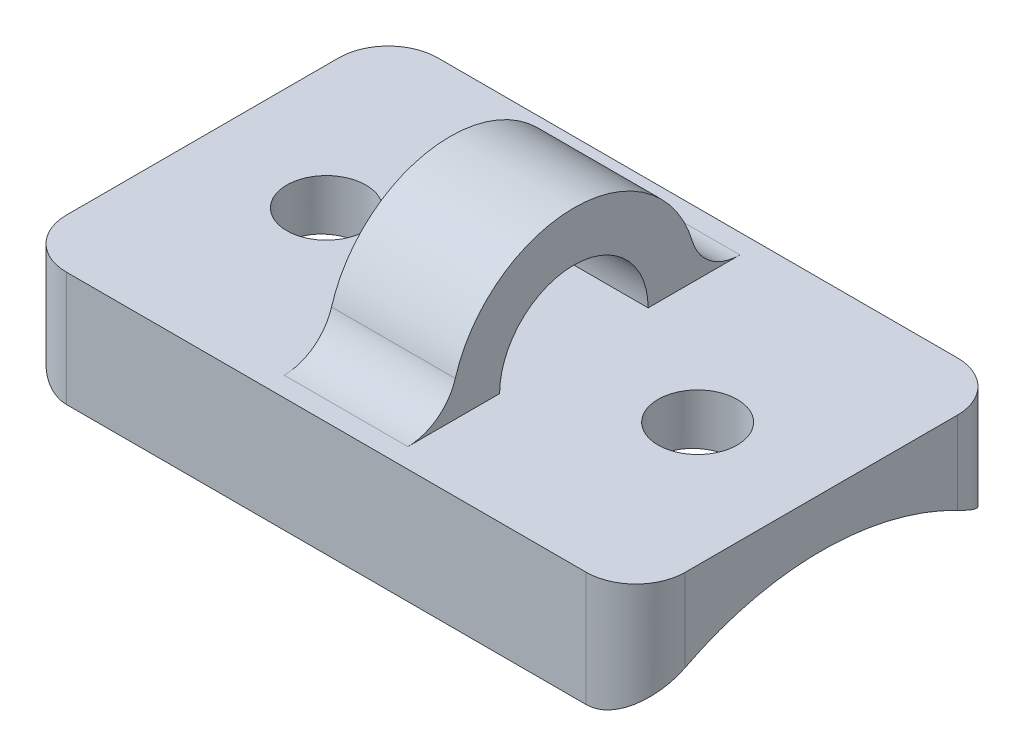
ISO-10303-21;
HEADER;
FILE_DESCRIPTION(('STEP AP214'),'2;1');
FILE_NAME('part.step','',(''),(''),'','','');
FILE_SCHEMA(('AUTOMOTIVE_DESIGN { 1 0 10303 214 1 1 1 1 }'));
ENDSEC;
DATA;
#1=APPLICATION_CONTEXT('core data for automotive mechanical design processes');
#2=APPLICATION_PROTOCOL_DEFINITION('international standard','automotive_design',2000,#1);
#3=PRODUCT_CONTEXT('',#1,'mechanical');
#4=PRODUCT('Part','Part','',(#3));
#5=PRODUCT_RELATED_PRODUCT_CATEGORY('part','',(#4));
#6=PRODUCT_DEFINITION_FORMATION('','',#4);
#7=PRODUCT_DEFINITION_CONTEXT('part definition',#1,'design');
#8=PRODUCT_DEFINITION('design','',#6,#7);
#9=PRODUCT_DEFINITION_SHAPE('','',#8);
#10=(LENGTH_UNIT() NAMED_UNIT(*) SI_UNIT(.MILLI.,.METRE.));
#11=(NAMED_UNIT(*) PLANE_ANGLE_UNIT() SI_UNIT($,.RADIAN.));
#12=(NAMED_UNIT(*) SI_UNIT($,.STERADIAN.) SOLID_ANGLE_UNIT());
#13=UNCERTAINTY_MEASURE_WITH_UNIT(LENGTH_MEASURE(1.E-05),#10,'distance_accuracy_value','');
#14=(GEOMETRIC_REPRESENTATION_CONTEXT(3) GLOBAL_UNCERTAINTY_ASSIGNED_CONTEXT((#13)) GLOBAL_UNIT_ASSIGNED_CONTEXT((#10,
#11,#12)) REPRESENTATION_CONTEXT('',''));
#15=CARTESIAN_POINT('',(0.,0.,0.));
#16=DIRECTION('',(0.,0.,1.));
#17=DIRECTION('',(1.,0.,0.));
#18=AXIS2_PLACEMENT_3D('',#15,#16,#17);
#19=CARTESIAN_POINT('',(12.5,14.,7.5));
#20=DIRECTION('',(0.,-1.,0.));
#21=DIRECTION('',(0.,0.,-1.));
#22=AXIS2_PLACEMENT_3D('',#19,#20,#21);
#23=PLANE('',#22);
#24=CARTESIAN_POINT('',(-7.5,14.,0.));
#25=DIRECTION('',(0.,1.,0.));
#26=DIRECTION('',(0.,0.,1.));
#27=AXIS2_PLACEMENT_3D('',#24,#25,#26);
#28=CIRCLE('',#27,1.59999999999999);
#29=CARTESIAN_POINT('',(-7.5,14.,1.59999999999999));
#30=VERTEX_POINT('',#29);
#31=EDGE_CURVE('E334',#30,#30,#28,.T.);
#32=ORIENTED_EDGE('',*,*,#31,.F.);
#33=EDGE_LOOP('',(#32));
#34=FACE_BOUND('',#33,.T.);
#35=CARTESIAN_POINT('',(7.5,14.,0.));
#36=DIRECTION('',(0.,1.,0.));
#37=DIRECTION('',(0.,0.,1.));
#38=AXIS2_PLACEMENT_3D('',#35,#36,#37);
#39=CIRCLE('',#38,1.59999999999999);
#40=CARTESIAN_POINT('',(7.5,14.,1.59999999999999));
#41=VERTEX_POINT('',#40);
#42=EDGE_CURVE('E296',#41,#41,#39,.T.);
#43=ORIENTED_EDGE('',*,*,#42,.F.);
#44=EDGE_LOOP('',(#43));
#45=FACE_BOUND('',#44,.T.);
#46=DIRECTION('',(0.,0.,-1.));
#47=VECTOR('',#46,1.);
#48=CARTESIAN_POINT('',(-2.5,14.,-3.));
#49=LINE('',#48,#47);
#50=CARTESIAN_POINT('',(-2.5,14.,-3.));
#51=VERTEX_POINT('',#50);
#52=CARTESIAN_POINT('',(-2.5,14.,-6.70820393249937));
#53=VERTEX_POINT('',#52);
#54=EDGE_CURVE('E340',#51,#53,#49,.T.);
#55=ORIENTED_EDGE('',*,*,#54,.T.);
#56=DIRECTION('',(1.,0.,0.));
#57=VECTOR('',#56,1.);
#58=CARTESIAN_POINT('',(2.5,14.,-6.70820393249937));
#59=LINE('',#58,#57);
#60=CARTESIAN_POINT('',(2.5,14.,-6.70820393249937));
#61=VERTEX_POINT('',#60);
#62=EDGE_CURVE('E220',#53,#61,#59,.T.);
#63=ORIENTED_EDGE('',*,*,#62,.T.);
#64=DIRECTION('',(0.,0.,-1.));
#65=VECTOR('',#64,1.);
#66=CARTESIAN_POINT('',(2.5,14.,-3.));
#67=LINE('',#66,#65);
#68=CARTESIAN_POINT('',(2.5,14.,-3.));
#69=VERTEX_POINT('',#68);
#70=EDGE_CURVE('E167',#69,#61,#67,.T.);
#71=ORIENTED_EDGE('',*,*,#70,.F.);
#72=DIRECTION('',(-1.,0.,0.));
#73=VECTOR('',#72,1.);
#74=CARTESIAN_POINT('',(2.5,14.,-3.));
#75=LINE('',#74,#73);
#76=EDGE_CURVE('E164',#69,#51,#75,.T.);
#77=ORIENTED_EDGE('',*,*,#76,.T.);
#78=EDGE_LOOP('',(#55,#63,#71,#77));
#79=FACE_BOUND('',#78,.T.);
#80=DIRECTION('',(0.,0.,1.));
#81=VECTOR('',#80,1.);
#82=CARTESIAN_POINT('',(12.5,14.,7.5));
#83=LINE('',#82,#81);
#84=CARTESIAN_POINT('',(12.5,14.,-5.5));
#85=VERTEX_POINT('',#84);
#86=CARTESIAN_POINT('',(12.5,14.,5.5));
#87=VERTEX_POINT('',#86);
#88=EDGE_CURVE('E186',#85,#87,#83,.T.);
#89=ORIENTED_EDGE('',*,*,#88,.F.);
#90=CARTESIAN_POINT('',(10.5,14.,-5.5));
#91=DIRECTION('',(0.,-1.,0.));
#92=DIRECTION('',(0.,0.,-1.));
#93=AXIS2_PLACEMENT_3D('',#90,#91,#92);
#94=CIRCLE('',#93,2.);
#95=CARTESIAN_POINT('',(10.5,14.,-7.5));
#96=VERTEX_POINT('',#95);
#97=EDGE_CURVE('E233',#85,#96,#94,.F.);
#98=ORIENTED_EDGE('',*,*,#97,.T.);
#99=DIRECTION('',(-1.,0.,0.));
#100=VECTOR('',#99,1.);
#101=CARTESIAN_POINT('',(12.5,14.,-7.5));
#102=LINE('',#101,#100);
#103=CARTESIAN_POINT('',(-10.5,14.,-7.5));
#104=VERTEX_POINT('',#103);
#105=EDGE_CURVE('E201',#96,#104,#102,.T.);
#106=ORIENTED_EDGE('',*,*,#105,.T.);
#107=CARTESIAN_POINT('',(-10.5,14.,-5.5));
#108=DIRECTION('',(0.,-1.,0.));
#109=DIRECTION('',(0.,0.,-1.));
#110=AXIS2_PLACEMENT_3D('',#107,#108,#109);
#111=CIRCLE('',#110,2.);
#112=CARTESIAN_POINT('',(-12.5,14.,-5.5));
#113=VERTEX_POINT('',#112);
#114=EDGE_CURVE('E230',#104,#113,#111,.F.);
#115=ORIENTED_EDGE('',*,*,#114,.T.);
#116=DIRECTION('',(0.,0.,1.));
#117=VECTOR('',#116,1.);
#118=CARTESIAN_POINT('',(-12.5,14.,7.5));
#119=LINE('',#118,#117);
#120=CARTESIAN_POINT('',(-12.5,14.,5.5));
#121=VERTEX_POINT('',#120);
#122=EDGE_CURVE('E177',#113,#121,#119,.T.);
#123=ORIENTED_EDGE('',*,*,#122,.T.);
#124=CARTESIAN_POINT('',(-10.5,14.,5.5));
#125=DIRECTION('',(0.,-1.,0.));
#126=DIRECTION('',(0.,0.,-1.));
#127=AXIS2_PLACEMENT_3D('',#124,#125,#126);
#128=CIRCLE('',#127,2.);
#129=CARTESIAN_POINT('',(-10.5,14.,7.5));
#130=VERTEX_POINT('',#129);
#131=EDGE_CURVE('E227',#121,#130,#128,.F.);
#132=ORIENTED_EDGE('',*,*,#131,.T.);
#133=DIRECTION('',(-1.,0.,0.));
#134=VECTOR('',#133,1.);
#135=CARTESIAN_POINT('',(12.5,14.,7.5));
#136=LINE('',#135,#134);
#137=CARTESIAN_POINT('',(10.5,14.,7.5));
#138=VERTEX_POINT('',#137);
#139=EDGE_CURVE('E197',#138,#130,#136,.T.);
#140=ORIENTED_EDGE('',*,*,#139,.F.);
#141=CARTESIAN_POINT('',(10.5,14.,5.5));
#142=DIRECTION('',(0.,-1.,0.));
#143=DIRECTION('',(0.,0.,-1.));
#144=AXIS2_PLACEMENT_3D('',#141,#142,#143);
#145=CIRCLE('',#144,2.);
#146=EDGE_CURVE('E224',#138,#87,#145,.F.);
#147=ORIENTED_EDGE('',*,*,#146,.T.);
#148=EDGE_LOOP('',(#89,#98,#106,#115,#123,#132,#140,#147));
#149=FACE_BOUND('',#148,.T.);
#150=DIRECTION('',(1.,0.,0.));
#151=VECTOR('',#150,1.);
#152=CARTESIAN_POINT('',(-2.5,14.,6.70820393249937));
#153=LINE('',#152,#151);
#154=CARTESIAN_POINT('',(2.5,14.,6.70820393249937));
#155=VERTEX_POINT('',#154);
#156=CARTESIAN_POINT('',(-2.5,14.,6.70820393249937));
#157=VERTEX_POINT('',#156);
#158=EDGE_CURVE('E217',#155,#157,#153,.F.);
#159=ORIENTED_EDGE('',*,*,#158,.T.);
#160=DIRECTION('',(0.,0.,-1.));
#161=VECTOR('',#160,1.);
#162=CARTESIAN_POINT('',(-2.5,14.,5.));
#163=LINE('',#162,#161);
#164=CARTESIAN_POINT('',(-2.5,14.,3.));
#165=VERTEX_POINT('',#164);
#166=EDGE_CURVE('E169',#157,#165,#163,.T.);
#167=ORIENTED_EDGE('',*,*,#166,.T.);
#168=DIRECTION('',(-1.,0.,0.));
#169=VECTOR('',#168,1.);
#170=CARTESIAN_POINT('',(2.5,14.,3.));
#171=LINE('',#170,#169);
#172=CARTESIAN_POINT('',(2.5,14.,3.));
#173=VERTEX_POINT('',#172);
#174=EDGE_CURVE('E161',#173,#165,#171,.T.);
#175=ORIENTED_EDGE('',*,*,#174,.F.);
#176=DIRECTION('',(0.,0.,-1.));
#177=VECTOR('',#176,1.);
#178=CARTESIAN_POINT('',(2.5,14.,5.));
#179=LINE('',#178,#177);
#180=EDGE_CURVE('E145',#155,#173,#179,.T.);
#181=ORIENTED_EDGE('',*,*,#180,.F.);
#182=EDGE_LOOP('',(#159,#167,#175,#181));
#183=FACE_BOUND('',#182,.T.);
#184=ADVANCED_FACE('F38',(#34,#45,#79,#149,#183),#23,.F.);
#185=CARTESIAN_POINT('',(12.5,0.,0.));
#186=DIRECTION('',(-1.,0.,0.));
#187=DIRECTION('',(0.,0.,1.));
#188=AXIS2_PLACEMENT_3D('',#185,#186,#187);
#189=CYLINDRICAL_SURFACE('',#188,12.);
#190=CARTESIAN_POINT('',(-7.5,11.8928549978548,1.6));
#191=CARTESIAN_POINT('',(-7.41055691563181,11.8928563562661,1.59999622875873));
#192=CARTESIAN_POINT('',(-7.32105917352575,11.8938749179493,1.59247461363655));
#193=CARTESIAN_POINT('',(-7.14455803014886,11.8978371896282,1.56259037013243));
#194=CARTESIAN_POINT('',(-7.05755727606974,11.9007828692913,1.54021255719325));
#195=CARTESIAN_POINT('',(-6.88863090541277,11.9082599369349,1.48129048912082));
#196=CARTESIAN_POINT('',(-6.8067017507042,11.9127902044355,1.44475624220001));
#197=CARTESIAN_POINT('',(-6.65015113943402,11.9229246580757,1.35858051904583));
#198=CARTESIAN_POINT('',(-6.57552851285003,11.9285286718458,1.30894114610784));
#199=CARTESIAN_POINT('',(-6.43522123626478,11.9402190185494,1.19762696391604));
#200=CARTESIAN_POINT('',(-6.36958970745638,11.9463079079454,1.13588545819885));
#201=CARTESIAN_POINT('',(-6.24958700363502,11.9582590100703,1.0022633829809));
#202=CARTESIAN_POINT('',(-6.19521640681908,11.9641212111471,0.93038229317759));
#203=CARTESIAN_POINT('',(-6.09908652662685,11.9749847980817,0.778185379942081));
#204=CARTESIAN_POINT('',(-6.0573756085678,11.9799828520179,0.697838750168974));
#205=CARTESIAN_POINT('',(-5.98805906865538,11.9885268273268,0.531203052829894));
#206=CARTESIAN_POINT('',(-5.96045285409787,11.9920728097169,0.44491423513792));
#207=CARTESIAN_POINT('',(-5.92028887233579,11.9972950895648,0.269388300011272));
#208=CARTESIAN_POINT('',(-5.90764254799044,11.9989823856406,0.180171778775919));
#209=CARTESIAN_POINT('',(-5.89748271301055,12.0003347837722,0.000868001842927265));
#210=CARTESIAN_POINT('',(-5.8999685298108,11.9999999757026,-0.0892192149779704));
#211=CARTESIAN_POINT('',(-5.91993178443277,11.9973547529353,-0.267104099572612));
#212=CARTESIAN_POINT('',(-5.93731397179653,11.9950568907025,-0.354912669889424));
#213=CARTESIAN_POINT('',(-5.98642746161722,11.9887577927383,-0.526355298170039));
#214=CARTESIAN_POINT('',(-6.0181590681345,11.9847565209123,-0.609989267633466));
#215=CARTESIAN_POINT('',(-6.09517075289747,11.9754785520333,-0.771001446739297));
#216=CARTESIAN_POINT('',(-6.14049169854648,11.970198017167,-0.848359879482602));
#217=CARTESIAN_POINT('',(-6.24336580582629,11.9589516033523,-0.994409352587822));
#218=CARTESIAN_POINT('',(-6.30091960530225,11.9529856886743,-1.06309994069345));
#219=CARTESIAN_POINT('',(-6.42715827868715,11.9409807047653,-1.1904240492363));
#220=CARTESIAN_POINT('',(-6.49592621455491,11.9349414273952,-1.24897522682416));
#221=CARTESIAN_POINT('',(-6.64235674509806,11.9235159901539,-1.35371754445752));
#222=CARTESIAN_POINT('',(-6.72001937504238,11.9181298328726,-1.39990863549082));
#223=CARTESIAN_POINT('',(-6.88211200027737,11.9086206106747,-1.47862628869199));
#224=CARTESIAN_POINT('',(-6.9665455236148,11.9044982097183,-1.51114567125364));
#225=CARTESIAN_POINT('',(-7.1397424165107,11.8979958037258,-1.56152072035938));
#226=CARTESIAN_POINT('',(-7.22850554722126,11.8956157026893,-1.57937719483314));
#227=CARTESIAN_POINT('',(-7.40711306800397,11.8928851600828,-1.5998092861498));
#228=CARTESIAN_POINT('',(-7.49694394426603,11.892519292093,-1.60250104879049));
#229=CARTESIAN_POINT('',(-7.67577540488379,11.8938177943736,-1.59283430551036));
#230=CARTESIAN_POINT('',(-7.76477600939156,11.895482115238,-1.5804761658382));
#231=CARTESIAN_POINT('',(-7.93906878912449,11.9006393634942,-1.54115844029615));
#232=CARTESIAN_POINT('',(-8.02437399441448,11.9041251823012,-1.51425560258687));
#233=CARTESIAN_POINT('',(-8.18926313076195,11.9125268721153,-1.44667076064099));
#234=CARTESIAN_POINT('',(-8.26884683465897,11.9174427998627,-1.40598820967505));
#235=CARTESIAN_POINT('',(-8.42055784835265,11.9281875729561,-1.31171525133768));
#236=CARTESIAN_POINT('',(-8.49263763869459,11.9340217103131,-1.25804898533039));
#237=CARTESIAN_POINT('',(-8.62680875074967,11.9459291481321,-1.13943865850238));
#238=CARTESIAN_POINT('',(-8.68889962891841,11.9520024591995,-1.07449409715002));
#239=CARTESIAN_POINT('',(-8.80174124313689,11.9637515892427,-0.934662038686582));
#240=CARTESIAN_POINT('',(-8.85241545309728,11.9694245603977,-0.859712512746012));
#241=CARTESIAN_POINT('',(-8.94045462574026,11.9796907318264,-0.70229796185409));
#242=CARTESIAN_POINT('',(-8.97781988780488,11.9842839563879,-0.619833106010954));
#243=CARTESIAN_POINT('',(-9.0380554092705,11.9918605175292,-0.449978218018742));
#244=CARTESIAN_POINT('',(-9.06096914326683,11.9948486785663,-0.362603827397885));
#245=CARTESIAN_POINT('',(-9.09179238836878,11.9988985334929,-0.185205194738555));
#246=CARTESIAN_POINT('',(-9.09970267416616,11.999960326849,-0.095181089759855));
#247=CARTESIAN_POINT('',(-9.10027861379225,12.0000371779874,0.0842158989692738));
#248=CARTESIAN_POINT('',(-9.09306197647551,11.9990680393074,0.173588420737507));
#249=CARTESIAN_POINT('',(-9.06383916701441,11.9952234657589,0.349837954441884));
#250=CARTESIAN_POINT('',(-9.04183301558295,11.9923480335601,0.436714969872839));
#251=CARTESIAN_POINT('',(-8.98369436233866,11.9850124531398,0.605486587671088));
#252=CARTESIAN_POINT('',(-8.94756829887355,11.9805530272665,0.687383441235129));
#253=CARTESIAN_POINT('',(-8.8622275602834,11.9705419951679,0.843971262904699));
#254=CARTESIAN_POINT('',(-8.81301264347804,11.9649903687759,0.918662097919331));
#255=CARTESIAN_POINT('',(-8.70245865439708,11.9533623296788,1.05931782885339));
#256=CARTESIAN_POINT('',(-8.64103216788865,11.9472823223993,1.1252137257312));
#257=CARTESIAN_POINT('',(-8.5079815447621,11.9353109191741,1.24580716469773));
#258=CARTESIAN_POINT('',(-8.43635500486297,11.9294195680805,1.30050206024185));
#259=CARTESIAN_POINT('',(-8.2845728467433,11.9184648790805,1.39735032782796));
#260=CARTESIAN_POINT('',(-8.20438112679198,11.9134052940863,1.43944752343302));
#261=CARTESIAN_POINT('',(-8.03804122598629,11.9047309326699,1.5095161462519));
#262=CARTESIAN_POINT('',(-7.95189954419226,11.9011146081783,1.53750271733087));
#263=CARTESIAN_POINT('',(-7.80444137701973,11.8966010705995,1.5719638430287));
#264=CARTESIAN_POINT('',(-7.74404938162601,11.8952034289778,1.58246198508654));
#265=CARTESIAN_POINT('',(-7.62244679242308,11.8933299317957,1.59648132274532));
#266=CARTESIAN_POINT('',(-7.56123620608016,11.8928540678337,1.60000258193809));
#267=CARTESIAN_POINT('',(-7.5,11.8928549978548,1.6));
#268=B_SPLINE_CURVE_WITH_KNOTS('',3,(#190,#191,#192,#193,#194,#195,#196,#197,#198,#199,#200,
#201,#202,#203,#204,#205,#206,#207,#208,#209,#210,#211,#212,#213,#214,#215,#216,#217,#218,#219,
#220,#221,#222,#223,#224,#225,#226,#227,#228,#229,#230,#231,#232,#233,#234,#235,#236,#237,#238,
#239,#240,#241,#242,#243,#244,#245,#246,#247,#248,#249,#250,#251,#252,#253,#254,#255,#256,#257,
#258,#259,#260,#261,#262,#263,#264,#265,#266,#267),.UNSPECIFIED.,.T.,.F.,(4,2,2,2,2,2,2,2,2,2,2,
2,2,2,2,2,2,2,2,2,2,2,2,2,2,2,2,2,2,2,2,2,2,2,2,2,2,2,4),(0.,0.268105511391278,
0.536485476866912,0.80467605019696,1.07282360666201,1.34249276095168,1.61217575808027,
1.88287645218353,2.15356577003778,2.42264455618211,2.69171138290121,2.95907046934198,
3.22643522131578,3.49461222763236,3.76280322065938,4.03307932053402,4.30335649213508,
4.57377542122827,4.84417944917516,5.11250962063778,5.38083326225068,5.6481174785311,
5.91541230092802,6.184308225121,6.45321608598731,6.72387609409837,6.99453001338355,
7.26436579014501,7.53418763375951,7.80191767883273,8.06964734894746,8.33725508278388,
8.60486775823095,8.87446993893387,9.14413574725753,9.41498673583912,9.68554641848823,
9.86910352753636,10.0526589635184),.UNSPECIFIED.);
#269=CARTESIAN_POINT('',(-7.5,11.8928549978548,1.6));
#270=VERTEX_POINT('',#269);
#271=EDGE_CURVE('E42',#270,#270,#268,.T.);
#272=ORIENTED_EDGE('',*,*,#271,.T.);
#273=EDGE_LOOP('',(#272));
#274=FACE_BOUND('',#273,.T.);
#275=CARTESIAN_POINT('',(7.5,11.8928549978548,1.59999999999999));
#276=CARTESIAN_POINT('',(7.58944308436819,11.8928563562661,1.59999622875873));
#277=CARTESIAN_POINT('',(7.67894082647425,11.8938749179493,1.59247461363655));
#278=CARTESIAN_POINT('',(7.85544196985114,11.8978371896282,1.56259037013243));
#279=CARTESIAN_POINT('',(7.94244272393026,11.9007828692913,1.54021255719325));
#280=CARTESIAN_POINT('',(8.11136909458724,11.9082599369349,1.48129048912081));
#281=CARTESIAN_POINT('',(8.19329824929581,11.9127902044355,1.4447562422));
#282=CARTESIAN_POINT('',(8.34984886056599,11.9229246580757,1.35858051904583));
#283=CARTESIAN_POINT('',(8.42447148714998,11.9285286718458,1.30894114610784));
#284=CARTESIAN_POINT('',(8.56477876373522,11.9402190185494,1.19762696391604));
#285=CARTESIAN_POINT('',(8.63041029254362,11.9463079079454,1.13588545819884));
#286=CARTESIAN_POINT('',(8.75041299636498,11.9582590100703,1.0022633829809));
#287=CARTESIAN_POINT('',(8.80478359318092,11.9641212111471,0.930382293177588));
#288=CARTESIAN_POINT('',(8.90091347337315,11.9749847980817,0.778185379942079));
#289=CARTESIAN_POINT('',(8.9426243914322,11.9799828520179,0.697838750168973));
#290=CARTESIAN_POINT('',(9.01194093134462,11.9885268273268,0.531203052829893));
#291=CARTESIAN_POINT('',(9.03954714590213,11.9920728097169,0.444914235137919));
#292=CARTESIAN_POINT('',(9.07971112766421,11.9972950895648,0.26938830001127));
#293=CARTESIAN_POINT('',(9.09235745200956,11.9989823856406,0.180171778775918));
#294=CARTESIAN_POINT('',(9.10251728698945,12.0003347837722,0.000868001842925666));
#295=CARTESIAN_POINT('',(9.10003147018921,11.9999999757026,-0.0892192149779722));
#296=CARTESIAN_POINT('',(9.08006821556724,11.9973547529353,-0.267104099572614));
#297=CARTESIAN_POINT('',(9.06268602820348,11.9950568907025,-0.354912669889426));
#298=CARTESIAN_POINT('',(9.01357253838279,11.9887577927383,-0.526355298170041));
#299=CARTESIAN_POINT('',(8.9818409318655,11.9847565209123,-0.609989267633469));
#300=CARTESIAN_POINT('',(8.90482924710254,11.9754785520333,-0.771001446739299));
#301=CARTESIAN_POINT('',(8.85950830145353,11.970198017167,-0.848359879482603));
#302=CARTESIAN_POINT('',(8.75663419417371,11.9589516033523,-0.994409352587823));
#303=CARTESIAN_POINT('',(8.69908039469775,11.9529856886743,-1.06309994069345));
#304=CARTESIAN_POINT('',(8.57284172131285,11.9409807047653,-1.1904240492363));
#305=CARTESIAN_POINT('',(8.50407378544509,11.9349414273952,-1.24897522682416));
#306=CARTESIAN_POINT('',(8.35764325490194,11.9235159901539,-1.35371754445752));
#307=CARTESIAN_POINT('',(8.27998062495762,11.9181298328726,-1.39990863549082));
#308=CARTESIAN_POINT('',(8.11788799972263,11.9086206106747,-1.47862628869199));
#309=CARTESIAN_POINT('',(8.03345447638521,11.9044982097183,-1.51114567125365));
#310=CARTESIAN_POINT('',(7.8602575834893,11.8979958037258,-1.56152072035938));
#311=CARTESIAN_POINT('',(7.77149445277875,11.8956157026893,-1.57937719483314));
#312=CARTESIAN_POINT('',(7.59288693199603,11.8928851600828,-1.59980928614981));
#313=CARTESIAN_POINT('',(7.50305605573397,11.892519292093,-1.60250104879049));
#314=CARTESIAN_POINT('',(7.32422459511621,11.8938177943736,-1.59283430551036));
#315=CARTESIAN_POINT('',(7.23522399060844,11.895482115238,-1.5804761658382));
#316=CARTESIAN_POINT('',(7.06093121087551,11.9006393634942,-1.54115844029615));
#317=CARTESIAN_POINT('',(6.97562600558552,11.9041251823012,-1.51425560258687));
#318=CARTESIAN_POINT('',(6.81073686923805,11.9125268721153,-1.44667076064099));
#319=CARTESIAN_POINT('',(6.73115316534103,11.9174427998627,-1.40598820967506));
#320=CARTESIAN_POINT('',(6.57944215164735,11.9281875729561,-1.31171525133768));
#321=CARTESIAN_POINT('',(6.50736236130541,11.9340217103131,-1.2580489853304));
#322=CARTESIAN_POINT('',(6.37319124925033,11.9459291481321,-1.13943865850238));
#323=CARTESIAN_POINT('',(6.31110037108159,11.9520024591995,-1.07449409715003));
#324=CARTESIAN_POINT('',(6.19825875686311,11.9637515892427,-0.934662038686584));
#325=CARTESIAN_POINT('',(6.14758454690272,11.9694245603977,-0.859712512746014));
#326=CARTESIAN_POINT('',(6.05954537425974,11.9796907318264,-0.702297961854092));
#327=CARTESIAN_POINT('',(6.02218011219512,11.9842839563879,-0.619833106010955));
#328=CARTESIAN_POINT('',(5.9619445907295,11.9918605175292,-0.449978218018743));
#329=CARTESIAN_POINT('',(5.93903085673317,11.9948486785663,-0.362603827397886));
#330=CARTESIAN_POINT('',(5.90820761163122,11.9988985334929,-0.185205194738556));
#331=CARTESIAN_POINT('',(5.90029732583384,11.999960326849,-0.0951810897598568));
#332=CARTESIAN_POINT('',(5.89972138620775,12.0000371779874,0.0842158989692719));
#333=CARTESIAN_POINT('',(5.90693802352449,11.9990680393074,0.173588420737505));
#334=CARTESIAN_POINT('',(5.93616083298559,11.9952234657589,0.349837954441882));
#335=CARTESIAN_POINT('',(5.95816698441705,11.9923480335601,0.436714969872837));
#336=CARTESIAN_POINT('',(6.01630563766134,11.9850124531398,0.605486587671086));
#337=CARTESIAN_POINT('',(6.05243170112645,11.9805530272665,0.687383441235126));
#338=CARTESIAN_POINT('',(6.1377724397166,11.9705419951679,0.843971262904696));
#339=CARTESIAN_POINT('',(6.18698735652196,11.9649903687759,0.918662097919329));
#340=CARTESIAN_POINT('',(6.29754134560292,11.9533623296788,1.05931782885339));
#341=CARTESIAN_POINT('',(6.35896783211136,11.9472823223993,1.12521372573119));
#342=CARTESIAN_POINT('',(6.4920184552379,11.9353109191741,1.24580716469772));
#343=CARTESIAN_POINT('',(6.56364499513703,11.9294195680805,1.30050206024184));
#344=CARTESIAN_POINT('',(6.7154271532567,11.9184648790805,1.39735032782796));
#345=CARTESIAN_POINT('',(6.79561887320802,11.9134052940863,1.43944752343302));
#346=CARTESIAN_POINT('',(6.96195877401371,11.9047309326699,1.5095161462519));
#347=CARTESIAN_POINT('',(7.04810045580774,11.9011146081783,1.53750271733087));
#348=CARTESIAN_POINT('',(7.19555862298027,11.8966010705995,1.5719638430287));
#349=CARTESIAN_POINT('',(7.25595061837399,11.8952034289778,1.58246198508654));
#350=CARTESIAN_POINT('',(7.37755320757692,11.8933299317957,1.59648132274532));
#351=CARTESIAN_POINT('',(7.43876379391984,11.8928540678337,1.60000258193809));
#352=CARTESIAN_POINT('',(7.5,11.8928549978548,1.59999999999999));
#353=B_SPLINE_CURVE_WITH_KNOTS('',3,(#275,#276,#277,#278,#279,#280,#281,#282,#283,#284,#285,
#286,#287,#288,#289,#290,#291,#292,#293,#294,#295,#296,#297,#298,#299,#300,#301,#302,#303,#304,
#305,#306,#307,#308,#309,#310,#311,#312,#313,#314,#315,#316,#317,#318,#319,#320,#321,#322,#323,
#324,#325,#326,#327,#328,#329,#330,#331,#332,#333,#334,#335,#336,#337,#338,#339,#340,#341,#342,
#343,#344,#345,#346,#347,#348,#349,#350,#351,#352),.UNSPECIFIED.,.T.,.F.,(4,2,2,2,2,2,2,2,2,2,2,
2,2,2,2,2,2,2,2,2,2,2,2,2,2,2,2,2,2,2,2,2,2,2,2,2,2,2,4),(0.,0.268105511391278,
0.536485476866912,0.80467605019696,1.07282360666201,1.34249276095168,1.61217575808027,
1.88287645218353,2.15356577003778,2.42264455618211,2.69171138290121,2.95907046934198,
3.22643522131578,3.49461222763236,3.76280322065938,4.03307932053402,4.30335649213508,
4.57377542122827,4.84417944917516,5.11250962063778,5.38083326225068,5.6481174785311,
5.91541230092802,6.184308225121,6.45321608598731,6.72387609409837,6.99453001338355,
7.26436579014501,7.53418763375951,7.80191767883273,8.06964734894746,8.33725508278388,
8.60486775823096,8.87446993893387,9.14413574725753,9.41498673583913,9.68554641848824,
9.86910352753636,10.0526589635184),.UNSPECIFIED.);
#354=CARTESIAN_POINT('',(7.5,11.8928549978548,1.59999999999999));
#355=VERTEX_POINT('',#354);
#356=EDGE_CURVE('E288',#355,#355,#353,.T.);
#357=ORIENTED_EDGE('',*,*,#356,.T.);
#358=EDGE_LOOP('',(#357));
#359=FACE_BOUND('',#358,.T.);
#360=DIRECTION('',(-1.,0.,0.));
#361=VECTOR('',#360,1.);
#362=CARTESIAN_POINT('',(12.5,9.3674969975976,-7.5));
#363=LINE('',#362,#361);
#364=CARTESIAN_POINT('',(10.5,9.3674969975976,-7.5));
#365=VERTEX_POINT('',#364);
#366=CARTESIAN_POINT('',(-10.5,9.3674969975976,-7.5));
#367=VERTEX_POINT('',#366);
#368=EDGE_CURVE('E205',#365,#367,#363,.T.);
#369=ORIENTED_EDGE('',*,*,#368,.F.);
#370=CARTESIAN_POINT('',(10.5,9.3674969975976,-7.5));
#371=CARTESIAN_POINT('',(10.5483027772054,9.36748518940481,-7.50001065938136));
#372=CARTESIAN_POINT('',(10.5965971103689,9.36889765010843,-7.49825050148634));
#373=CARTESIAN_POINT('',(10.6927422412073,9.37448095716275,-7.49127111850991));
#374=CARTESIAN_POINT('',(10.7405933219699,9.37864989925439,-7.48605428139966));
#375=CARTESIAN_POINT('',(10.8351541696703,9.38961694197358,-7.47229321580569));
#376=CARTESIAN_POINT('',(10.8818696470536,9.39639605263106,-7.46377301748759));
#377=CARTESIAN_POINT('',(10.9741671529969,9.41242140785187,-7.44355356186978));
#378=CARTESIAN_POINT('',(11.0197490417945,9.42166795499773,-7.43185391466999));
#379=CARTESIAN_POINT('',(11.1541096256459,9.45277435397726,-7.39230582724774));
#380=CARTESIAN_POINT('',(11.2408302497661,9.47804087611767,-7.35995903788069));
#381=CARTESIAN_POINT('',(11.4070445134385,9.53590312823544,-7.28483298400655));
#382=CARTESIAN_POINT('',(11.4865250901421,9.56851175117555,-7.24203535618097));
#383=CARTESIAN_POINT('',(11.6443658717239,9.64260294226447,-7.14313412583954));
#384=CARTESIAN_POINT('',(11.7219207254887,9.68463114553839,-7.08615866108174));
#385=CARTESIAN_POINT('',(11.8666086491214,9.77330421018174,-6.9633520680936));
#386=CARTESIAN_POINT('',(11.9337384492114,9.81995051251852,-6.89751817348636));
#387=CARTESIAN_POINT('',(12.0702934880571,9.92635930479746,-6.74372642708985));
#388=CARTESIAN_POINT('',(12.1372265363322,9.98681563137287,-6.65402878005098));
#389=CARTESIAN_POINT('',(12.2548766096159,10.1097096071469,-6.46579108921748));
#390=CARTESIAN_POINT('',(12.3055817101428,10.1721486764248,-6.36724461097858));
#391=CARTESIAN_POINT('',(12.3975341985474,10.3081031440598,-6.145137147698));
#392=CARTESIAN_POINT('',(12.4355600214327,10.381639296582,-6.02022137521509));
#393=CARTESIAN_POINT('',(12.4739825871388,10.4899142463838,-5.82813487475246));
#394=CARTESIAN_POINT('',(12.4836876528553,10.5256899102315,-5.76327758240922));
#395=CARTESIAN_POINT('',(12.4966937016479,10.5962993662587,-5.6324044510695));
#396=CARTESIAN_POINT('',(12.4999934577272,10.6311329767193,-5.56638839254399));
#397=CARTESIAN_POINT('',(12.5,10.6653645038508,-5.5));
#398=B_SPLINE_CURVE_WITH_KNOTS('',3,(#370,#371,#372,#373,#374,#375,#376,#377,#378,#379,#380,
#381,#382,#383,#384,#385,#386,#387,#388,#389,#390,#391,#392,#393,#394,#395,#396,#397),
.UNSPECIFIED.,.F.,.F.,(4,2,2,2,2,2,2,2,2,2,2,2,2,4),(0.,0.144841850755566,0.289583744867532,
0.433291899385336,0.577017684985528,0.863482983835152,1.15045530340758,1.46436271982192,
1.77836839410086,2.15848244530262,2.53887517076651,2.98602691236172,3.20988927477969,
3.43379451588553),.UNSPECIFIED.);
#399=CARTESIAN_POINT('',(12.5,10.6653645038508,-5.5));
#400=VERTEX_POINT('',#399);
#401=EDGE_CURVE('E282',#365,#400,#398,.T.);
#402=ORIENTED_EDGE('',*,*,#401,.T.);
#403=CARTESIAN_POINT('',(12.5,0.,0.));
#404=DIRECTION('',(-1.,0.,0.));
#405=DIRECTION('',(0.,0.,1.));
#406=AXIS2_PLACEMENT_3D('',#403,#404,#405);
#407=CIRCLE('',#406,12.);
#408=CARTESIAN_POINT('',(12.5,10.6653645038508,5.5));
#409=VERTEX_POINT('',#408);
#410=EDGE_CURVE('E182',#409,#400,#407,.T.);
#411=ORIENTED_EDGE('',*,*,#410,.F.);
#412=CARTESIAN_POINT('',(12.5,10.6653645038508,5.5));
#413=CARTESIAN_POINT('',(12.4999991208543,10.6261543752966,5.57606038762321));
#414=CARTESIAN_POINT('',(12.4956618748706,10.5861232209921,5.65166494251072));
#415=CARTESIAN_POINT('',(12.4786126226478,10.5048814831019,5.80126134756968));
#416=CARTESIAN_POINT('',(12.4659025003599,10.4636711668303,5.87525355666112));
#417=CARTESIAN_POINT('',(12.4323828579233,10.3804602125327,6.02105625349903));
#418=CARTESIAN_POINT('',(12.4115625552251,10.3384585935054,6.09286369898746));
#419=CARTESIAN_POINT('',(12.3621077003237,10.2542381270974,6.23356489049806));
#420=CARTESIAN_POINT('',(12.3334738732171,10.21201930023,6.30245890620231));
#421=CARTESIAN_POINT('',(12.245899795002,10.0984209665159,6.48382408507596));
#422=CARTESIAN_POINT('',(12.1797682934898,10.0272937448297,6.5930808512241));
#423=CARTESIAN_POINT('',(12.0265147812645,9.88915821953748,6.79851879771753));
#424=CARTESIAN_POINT('',(11.9394235612864,9.82214405325641,6.89471883770976));
#425=CARTESIAN_POINT('',(11.7660242055572,9.70983195396632,7.05169433507001));
#426=CARTESIAN_POINT('',(11.6835964445014,9.6629672234091,7.11563548057065));
#427=CARTESIAN_POINT('',(11.5069690998895,9.5767785912491,7.23121717131463));
#428=CARTESIAN_POINT('',(11.4127833419778,9.53744596843613,7.2828719595667));
#429=CARTESIAN_POINT('',(11.2306592734798,9.47492506990583,7.36396481648052));
#430=CARTESIAN_POINT('',(11.144279747949,9.45014062332331,7.39566755813932));
#431=CARTESIAN_POINT('',(10.9660682311031,9.40963741023303,7.44713448377268));
#432=CARTESIAN_POINT('',(10.8742477589318,9.39390019630885,7.46692296499439));
#433=CARTESIAN_POINT('',(10.7346557647405,9.37810086587412,7.48674085173336));
#434=CARTESIAN_POINT('',(10.6879610326945,9.37413583864745,7.49170240230119));
#435=CARTESIAN_POINT('',(10.5941866630739,9.36883085400799,7.49833427397814));
#436=CARTESIAN_POINT('',(10.5471069895432,9.36749114469542,7.50000428402715));
#437=CARTESIAN_POINT('',(10.5,9.3674969975976,7.5));
#438=B_SPLINE_CURVE_WITH_KNOTS('',3,(#412,#413,#414,#415,#416,#417,#418,#419,#420,#421,#422,
#423,#424,#425,#426,#427,#428,#429,#430,#431,#432,#433,#434,#435,#436,#437),.UNSPECIFIED.,.F.,
.F.,(4,2,2,2,2,2,2,2,2,2,2,2,4),(0.,0.256559685899212,0.513061663923731,0.769905833751723,
1.02672617648487,1.46312789885976,1.89889240002621,2.24069523036195,2.58209987187782,
2.86682481378426,3.15096711998387,3.29217405122015,3.43339432628055),.UNSPECIFIED.);
#439=CARTESIAN_POINT('',(10.5,9.3674969975976,7.5));
#440=VERTEX_POINT('',#439);
#441=EDGE_CURVE('E243',#409,#440,#438,.T.);
#442=ORIENTED_EDGE('',*,*,#441,.T.);
#443=DIRECTION('',(-1.,0.,0.));
#444=VECTOR('',#443,1.);
#445=CARTESIAN_POINT('',(12.5,9.3674969975976,7.5));
#446=LINE('',#445,#444);
#447=CARTESIAN_POINT('',(-10.5,9.3674969975976,7.5));
#448=VERTEX_POINT('',#447);
#449=EDGE_CURVE('E189',#440,#448,#446,.T.);
#450=ORIENTED_EDGE('',*,*,#449,.T.);
#451=CARTESIAN_POINT('',(-10.5,9.3674969975976,7.5));
#452=CARTESIAN_POINT('',(-10.5483027772054,9.36748518940481,7.50001065938136));
#453=CARTESIAN_POINT('',(-10.5965971103689,9.36889765010843,7.49825050148634));
#454=CARTESIAN_POINT('',(-10.6927422412073,9.37448095716275,7.49127111850991));
#455=CARTESIAN_POINT('',(-10.7405933219699,9.37864989925439,7.48605428139966));
#456=CARTESIAN_POINT('',(-10.8351541696703,9.38961694197358,7.47229321580569));
#457=CARTESIAN_POINT('',(-10.8818696470536,9.39639605263106,7.46377301748759));
#458=CARTESIAN_POINT('',(-10.9741671529969,9.41242140785187,7.44355356186978));
#459=CARTESIAN_POINT('',(-11.0197490417945,9.42166795499773,7.43185391466999));
#460=CARTESIAN_POINT('',(-11.1541096256459,9.45277435397726,7.39230582724774));
#461=CARTESIAN_POINT('',(-11.2408302497661,9.47804087611767,7.35995903788069));
#462=CARTESIAN_POINT('',(-11.4070445134385,9.53590312823544,7.28483298400656));
#463=CARTESIAN_POINT('',(-11.4865250901421,9.56851175117555,7.24203535618097));
#464=CARTESIAN_POINT('',(-11.6443658717239,9.64260294226447,7.14313412583954));
#465=CARTESIAN_POINT('',(-11.7219207254887,9.68463114553839,7.08615866108174));
#466=CARTESIAN_POINT('',(-11.8666086491214,9.77330421018174,6.9633520680936));
#467=CARTESIAN_POINT('',(-11.9337384492114,9.81995051251852,6.89751817348636));
#468=CARTESIAN_POINT('',(-12.0702934880571,9.92635930479746,6.74372642708986));
#469=CARTESIAN_POINT('',(-12.1372265363322,9.98681563137287,6.65402878005098));
#470=CARTESIAN_POINT('',(-12.2548766096159,10.1097096071469,6.46579108921748));
#471=CARTESIAN_POINT('',(-12.3055817101428,10.1721486764248,6.36724461097858));
#472=CARTESIAN_POINT('',(-12.3975341985474,10.3081031440598,6.145137147698));
#473=CARTESIAN_POINT('',(-12.4355600214327,10.381639296582,6.02022137521509));
#474=CARTESIAN_POINT('',(-12.4739825871388,10.4899142463838,5.82813487475246));
#475=CARTESIAN_POINT('',(-12.4836876528553,10.5256899102315,5.76327758240922));
#476=CARTESIAN_POINT('',(-12.4966937016478,10.5962993662587,5.6324044510695));
#477=CARTESIAN_POINT('',(-12.4999934577272,10.6311329767193,5.56638839254399));
#478=CARTESIAN_POINT('',(-12.5,10.6653645038508,5.5));
#479=B_SPLINE_CURVE_WITH_KNOTS('',3,(#451,#452,#453,#454,#455,#456,#457,#458,#459,#460,#461,
#462,#463,#464,#465,#466,#467,#468,#469,#470,#471,#472,#473,#474,#475,#476,#477,#478),
.UNSPECIFIED.,.F.,.F.,(4,2,2,2,2,2,2,2,2,2,2,2,2,4),(0.,0.144841850755567,0.289583744867535,
0.433291899385337,0.577017684985528,0.86348298383515,1.15045530340758,1.46436271982192,
1.77836839410086,2.15848244530262,2.53887517076651,2.98602691236172,3.20988927477969,
3.43379451588553),.UNSPECIFIED.);
#480=CARTESIAN_POINT('',(-12.5,10.6653645038508,5.5));
#481=VERTEX_POINT('',#480);
#482=EDGE_CURVE('E251',#448,#481,#479,.T.);
#483=ORIENTED_EDGE('',*,*,#482,.T.);
#484=CARTESIAN_POINT('',(-12.5,0.,0.));
#485=DIRECTION('',(-1.,0.,0.));
#486=DIRECTION('',(0.,0.,1.));
#487=AXIS2_PLACEMENT_3D('',#484,#485,#486);
#488=CIRCLE('',#487,12.);
#489=CARTESIAN_POINT('',(-12.5,10.6653645038508,-5.5));
#490=VERTEX_POINT('',#489);
#491=EDGE_CURVE('E171',#481,#490,#488,.T.);
#492=ORIENTED_EDGE('',*,*,#491,.T.);
#493=CARTESIAN_POINT('',(-12.5,10.6653645038508,-5.5));
#494=CARTESIAN_POINT('',(-12.4999991208543,10.6261543752966,-5.57606038762321));
#495=CARTESIAN_POINT('',(-12.4956618748706,10.5861232209921,-5.65166494251072));
#496=CARTESIAN_POINT('',(-12.4786126226478,10.5048814831019,-5.80126134756968));
#497=CARTESIAN_POINT('',(-12.4659025003599,10.4636711668303,-5.87525355666112));
#498=CARTESIAN_POINT('',(-12.4323828579233,10.3804602125327,-6.02105625349903));
#499=CARTESIAN_POINT('',(-12.4115625552251,10.3384585935054,-6.09286369898746));
#500=CARTESIAN_POINT('',(-12.3621077003237,10.2542381270974,-6.23356489049806));
#501=CARTESIAN_POINT('',(-12.3334738732171,10.21201930023,-6.30245890620231));
#502=CARTESIAN_POINT('',(-12.245899795002,10.0984209665159,-6.48382408507596));
#503=CARTESIAN_POINT('',(-12.1797682934898,10.0272937448297,-6.5930808512241));
#504=CARTESIAN_POINT('',(-12.0265147812645,9.88915821953748,-6.79851879771753));
#505=CARTESIAN_POINT('',(-11.9394235612864,9.82214405325641,-6.89471883770976));
#506=CARTESIAN_POINT('',(-11.7660242055572,9.70983195396632,-7.05169433507001));
#507=CARTESIAN_POINT('',(-11.6835964445014,9.66296722340909,-7.11563548057065));
#508=CARTESIAN_POINT('',(-11.5069690998895,9.5767785912491,-7.23121717131463));
#509=CARTESIAN_POINT('',(-11.4127833419778,9.53744596843613,-7.2828719595667));
#510=CARTESIAN_POINT('',(-11.2306592734798,9.47492506990582,-7.36396481648052));
#511=CARTESIAN_POINT('',(-11.144279747949,9.45014062332331,-7.39566755813932));
#512=CARTESIAN_POINT('',(-10.9660682311031,9.40963741023303,-7.44713448377268));
#513=CARTESIAN_POINT('',(-10.8742477589318,9.39390019630885,-7.46692296499439));
#514=CARTESIAN_POINT('',(-10.7346557647405,9.37810086587412,-7.48674085173336));
#515=CARTESIAN_POINT('',(-10.6879610326945,9.37413583864745,-7.49170240230119));
#516=CARTESIAN_POINT('',(-10.5941866630739,9.36883085400799,-7.49833427397814));
#517=CARTESIAN_POINT('',(-10.5471069895432,9.36749114469542,-7.50000428402715));
#518=CARTESIAN_POINT('',(-10.5,9.3674969975976,-7.5));
#519=B_SPLINE_CURVE_WITH_KNOTS('',3,(#493,#494,#495,#496,#497,#498,#499,#500,#501,#502,#503,
#504,#505,#506,#507,#508,#509,#510,#511,#512,#513,#514,#515,#516,#517,#518),.UNSPECIFIED.,.F.,
.F.,(4,2,2,2,2,2,2,2,2,2,2,2,4),(0.,0.256559685899212,0.513061663923731,0.769905833751723,
1.02672617648487,1.46312789885976,1.89889240002621,2.24069523036195,2.58209987187782,
2.86682481378426,3.15096711998387,3.29217405122015,3.43339432628055),.UNSPECIFIED.);
#520=EDGE_CURVE('E276',#490,#367,#519,.T.);
#521=ORIENTED_EDGE('',*,*,#520,.T.);
#522=EDGE_LOOP('',(#369,#402,#411,#442,#450,#483,#492,#521));
#523=FACE_BOUND('',#522,.T.);
#524=ADVANCED_FACE('F260',(#274,#359,#523),#189,.F.);
#525=CARTESIAN_POINT('',(12.5,14.,-7.5));
#526=DIRECTION('',(0.,0.,1.));
#527=DIRECTION('',(1.,0.,0.));
#528=AXIS2_PLACEMENT_3D('',#525,#526,#527);
#529=PLANE('',#528);
#530=ORIENTED_EDGE('',*,*,#105,.F.);
#531=DIRECTION('',(0.,1.,0.));
#532=VECTOR('',#531,1.);
#533=CARTESIAN_POINT('',(10.5,14.,-7.5));
#534=LINE('',#533,#532);
#535=EDGE_CURVE('E240',#96,#365,#534,.F.);
#536=ORIENTED_EDGE('',*,*,#535,.T.);
#537=ORIENTED_EDGE('',*,*,#368,.T.);
#538=DIRECTION('',(0.,1.,0.));
#539=VECTOR('',#538,1.);
#540=CARTESIAN_POINT('',(-10.5,14.,-7.5));
#541=LINE('',#540,#539);
#542=EDGE_CURVE('E236',#367,#104,#541,.T.);
#543=ORIENTED_EDGE('',*,*,#542,.T.);
#544=EDGE_LOOP('',(#530,#536,#537,#543));
#545=FACE_BOUND('',#544,.T.);
#546=ADVANCED_FACE('F265',(#545),#529,.F.);
#547=CARTESIAN_POINT('',(12.5,9.3674969975976,7.5));
#548=DIRECTION('',(0.,0.,-1.));
#549=DIRECTION('',(-1.,0.,0.));
#550=AXIS2_PLACEMENT_3D('',#547,#548,#549);
#551=PLANE('',#550);
#552=ORIENTED_EDGE('',*,*,#139,.T.);
#553=DIRECTION('',(0.,-1.,0.));
#554=VECTOR('',#553,1.);
#555=CARTESIAN_POINT('',(-10.5,9.3674969975976,7.5));
#556=LINE('',#555,#554);
#557=EDGE_CURVE('E357',#130,#448,#556,.T.);
#558=ORIENTED_EDGE('',*,*,#557,.T.);
#559=ORIENTED_EDGE('',*,*,#449,.F.);
#560=DIRECTION('',(0.,-1.,0.));
#561=VECTOR('',#560,1.);
#562=CARTESIAN_POINT('',(10.5,9.3674969975976,7.5));
#563=LINE('',#562,#561);
#564=EDGE_CURVE('E351',#440,#138,#563,.F.);
#565=ORIENTED_EDGE('',*,*,#564,.T.);
#566=EDGE_LOOP('',(#552,#558,#559,#565));
#567=FACE_BOUND('',#566,.T.);
#568=ADVANCED_FACE('F320',(#567),#551,.F.);
#569=CARTESIAN_POINT('',(12.5,0.,0.));
#570=DIRECTION('',(-1.,0.,0.));
#571=DIRECTION('',(0.,0.,1.));
#572=AXIS2_PLACEMENT_3D('',#569,#570,#571);
#573=PLANE('',#572);
#574=ORIENTED_EDGE('',*,*,#410,.T.);
#575=DIRECTION('',(0.,1.,0.));
#576=VECTOR('',#575,1.);
#577=CARTESIAN_POINT('',(12.5,0.,-5.5));
#578=LINE('',#577,#576);
#579=EDGE_CURVE('E213',#400,#85,#578,.T.);
#580=ORIENTED_EDGE('',*,*,#579,.T.);
#581=ORIENTED_EDGE('',*,*,#88,.T.);
#582=DIRECTION('',(0.,-1.,0.));
#583=VECTOR('',#582,1.);
#584=CARTESIAN_POINT('',(12.5,0.,5.5));
#585=LINE('',#584,#583);
#586=EDGE_CURVE('E209',#87,#409,#585,.T.);
#587=ORIENTED_EDGE('',*,*,#586,.T.);
#588=EDGE_LOOP('',(#574,#580,#581,#587));
#589=FACE_BOUND('',#588,.T.);
#590=ADVANCED_FACE('F317',(#589),#573,.F.);
#591=CARTESIAN_POINT('',(-12.5,0.,0.));
#592=DIRECTION('',(-1.,0.,0.));
#593=DIRECTION('',(0.,0.,1.));
#594=AXIS2_PLACEMENT_3D('',#591,#592,#593);
#595=PLANE('',#594);
#596=ORIENTED_EDGE('',*,*,#122,.F.);
#597=DIRECTION('',(0.,1.,0.));
#598=VECTOR('',#597,1.);
#599=CARTESIAN_POINT('',(-12.5,9.3674969975976,-5.5));
#600=LINE('',#599,#598);
#601=EDGE_CURVE('E367',#113,#490,#600,.F.);
#602=ORIENTED_EDGE('',*,*,#601,.T.);
#603=ORIENTED_EDGE('',*,*,#491,.F.);
#604=DIRECTION('',(0.,-1.,0.));
#605=VECTOR('',#604,1.);
#606=CARTESIAN_POINT('',(-12.5,14.,5.5));
#607=LINE('',#606,#605);
#608=EDGE_CURVE('E582',#481,#121,#607,.F.);
#609=ORIENTED_EDGE('',*,*,#608,.T.);
#610=EDGE_LOOP('',(#596,#602,#603,#609));
#611=FACE_BOUND('',#610,.T.);
#612=ADVANCED_FACE('F316',(#611),#595,.T.);
#613=CARTESIAN_POINT('',(2.5,14.,0.));
#614=DIRECTION('',(-1.,0.,0.));
#615=DIRECTION('',(0.,0.,1.));
#616=AXIS2_PLACEMENT_3D('',#613,#614,#615);
#617=CYLINDRICAL_SURFACE('',#616,5.);
#618=CARTESIAN_POINT('',(2.5,14.,0.));
#619=DIRECTION('',(1.,0.,0.));
#620=DIRECTION('',(0.,0.,1.));
#621=AXIS2_PLACEMENT_3D('',#618,#619,#620);
#622=CIRCLE('',#621,5.);
#623=CARTESIAN_POINT('',(2.5,15.4285714285714,-4.79157423749955));
#624=VERTEX_POINT('',#623);
#625=CARTESIAN_POINT('',(2.5,15.4285714285714,4.79157423749955));
#626=VERTEX_POINT('',#625);
#627=EDGE_CURVE('E156',#624,#626,#622,.T.);
#628=ORIENTED_EDGE('',*,*,#627,.F.);
#629=DIRECTION('',(-1.,0.,0.));
#630=VECTOR('',#629,1.);
#631=CARTESIAN_POINT('',(2.5,15.4285714285714,-4.79157423749955));
#632=LINE('',#631,#630);
#633=CARTESIAN_POINT('',(-2.5,15.4285714285714,-4.79157423749955));
#634=VERTEX_POINT('',#633);
#635=EDGE_CURVE('E365',#624,#634,#632,.T.);
#636=ORIENTED_EDGE('',*,*,#635,.T.);
#637=CARTESIAN_POINT('',(-2.5,14.,0.));
#638=DIRECTION('',(1.,0.,0.));
#639=DIRECTION('',(0.,0.,1.));
#640=AXIS2_PLACEMENT_3D('',#637,#638,#639);
#641=CIRCLE('',#640,5.);
#642=CARTESIAN_POINT('',(-2.5,15.4285714285714,4.79157423749955));
#643=VERTEX_POINT('',#642);
#644=EDGE_CURVE('E295',#634,#643,#641,.T.);
#645=ORIENTED_EDGE('',*,*,#644,.T.);
#646=DIRECTION('',(-1.,0.,0.));
#647=VECTOR('',#646,1.);
#648=CARTESIAN_POINT('',(2.5,15.4285714285714,4.79157423749955));
#649=LINE('',#648,#647);
#650=EDGE_CURVE('E61',#643,#626,#649,.F.);
#651=ORIENTED_EDGE('',*,*,#650,.T.);
#652=EDGE_LOOP('',(#628,#636,#645,#651));
#653=FACE_BOUND('',#652,.T.);
#654=ADVANCED_FACE('F313',(#653),#617,.T.);
#655=CARTESIAN_POINT('',(2.5,14.,0.));
#656=DIRECTION('',(-1.,0.,0.));
#657=DIRECTION('',(0.,0.,1.));
#658=AXIS2_PLACEMENT_3D('',#655,#656,#657);
#659=CYLINDRICAL_SURFACE('',#658,3.);
#660=CARTESIAN_POINT('',(-2.5,14.,0.));
#661=DIRECTION('',(-1.,0.,0.));
#662=DIRECTION('',(0.,0.,1.));
#663=AXIS2_PLACEMENT_3D('',#660,#661,#662);
#664=CIRCLE('',#663,3.);
#665=EDGE_CURVE('E397',#165,#51,#664,.T.);
#666=ORIENTED_EDGE('',*,*,#665,.T.);
#667=ORIENTED_EDGE('',*,*,#76,.F.);
#668=CARTESIAN_POINT('',(2.5,14.,0.));
#669=DIRECTION('',(-1.,0.,0.));
#670=DIRECTION('',(0.,0.,1.));
#671=AXIS2_PLACEMENT_3D('',#668,#669,#670);
#672=CIRCLE('',#671,3.);
#673=EDGE_CURVE('E148',#173,#69,#672,.T.);
#674=ORIENTED_EDGE('',*,*,#673,.F.);
#675=ORIENTED_EDGE('',*,*,#174,.T.);
#676=EDGE_LOOP('',(#666,#667,#674,#675));
#677=FACE_BOUND('',#676,.T.);
#678=ADVANCED_FACE('F160',(#677),#659,.F.);
#679=CARTESIAN_POINT('',(2.5,14.,0.));
#680=DIRECTION('',(-1.,0.,0.));
#681=DIRECTION('',(0.,0.,1.));
#682=AXIS2_PLACEMENT_3D('',#679,#680,#681);
#683=PLANE('',#682);
#684=ORIENTED_EDGE('',*,*,#70,.T.);
#685=CARTESIAN_POINT('',(2.5,16.,-6.70820393249937));
#686=DIRECTION('',(-1.,0.,0.));
#687=DIRECTION('',(0.,0.,1.));
#688=AXIS2_PLACEMENT_3D('',#685,#686,#687);
#689=CIRCLE('',#688,2.);
#690=EDGE_CURVE('E68',#61,#624,#689,.T.);
#691=ORIENTED_EDGE('',*,*,#690,.T.);
#692=ORIENTED_EDGE('',*,*,#627,.T.);
#693=CARTESIAN_POINT('',(2.5,16.,6.70820393249937));
#694=DIRECTION('',(-1.,0.,0.));
#695=DIRECTION('',(0.,0.,1.));
#696=AXIS2_PLACEMENT_3D('',#693,#694,#695);
#697=CIRCLE('',#696,2.);
#698=EDGE_CURVE('E11',#626,#155,#697,.T.);
#699=ORIENTED_EDGE('',*,*,#698,.T.);
#700=ORIENTED_EDGE('',*,*,#180,.T.);
#701=ORIENTED_EDGE('',*,*,#673,.T.);
#702=EDGE_LOOP('',(#684,#691,#692,#699,#700,#701));
#703=FACE_BOUND('',#702,.T.);
#704=ADVANCED_FACE('F147',(#703),#683,.F.);
#705=CARTESIAN_POINT('',(-2.5,14.,0.));
#706=DIRECTION('',(-1.,0.,0.));
#707=DIRECTION('',(0.,0.,1.));
#708=AXIS2_PLACEMENT_3D('',#705,#706,#707);
#709=PLANE('',#708);
#710=ORIENTED_EDGE('',*,*,#644,.F.);
#711=CARTESIAN_POINT('',(-2.5,16.,-6.70820393249937));
#712=DIRECTION('',(-1.,0.,0.));
#713=DIRECTION('',(0.,0.,1.));
#714=AXIS2_PLACEMENT_3D('',#711,#712,#713);
#715=CIRCLE('',#714,2.);
#716=EDGE_CURVE('E374',#634,#53,#715,.F.);
#717=ORIENTED_EDGE('',*,*,#716,.T.);
#718=ORIENTED_EDGE('',*,*,#54,.F.);
#719=ORIENTED_EDGE('',*,*,#665,.F.);
#720=ORIENTED_EDGE('',*,*,#166,.F.);
#721=CARTESIAN_POINT('',(-2.5,16.,6.70820393249937));
#722=DIRECTION('',(-1.,0.,0.));
#723=DIRECTION('',(0.,0.,1.));
#724=AXIS2_PLACEMENT_3D('',#721,#722,#723);
#725=CIRCLE('',#724,2.);
#726=EDGE_CURVE('E53',#157,#643,#725,.F.);
#727=ORIENTED_EDGE('',*,*,#726,.T.);
#728=EDGE_LOOP('',(#710,#717,#718,#719,#720,#727));
#729=FACE_BOUND('',#728,.T.);
#730=ADVANCED_FACE('F307',(#729),#709,.T.);
#731=CARTESIAN_POINT('',(10.5,0.,-5.5));
#732=DIRECTION('',(0.,1.,0.));
#733=DIRECTION('',(0.,0.,1.));
#734=AXIS2_PLACEMENT_3D('',#731,#732,#733);
#735=CYLINDRICAL_SURFACE('',#734,2.);
#736=ORIENTED_EDGE('',*,*,#401,.F.);
#737=ORIENTED_EDGE('',*,*,#535,.F.);
#738=ORIENTED_EDGE('',*,*,#97,.F.);
#739=ORIENTED_EDGE('',*,*,#579,.F.);
#740=EDGE_LOOP('',(#736,#737,#738,#739));
#741=FACE_BOUND('',#740,.T.);
#742=ADVANCED_FACE('F268',(#741),#735,.T.);
#743=CARTESIAN_POINT('',(-10.5,14.,-5.5));
#744=DIRECTION('',(0.,-1.,0.));
#745=DIRECTION('',(0.,0.,-1.));
#746=AXIS2_PLACEMENT_3D('',#743,#744,#745);
#747=CYLINDRICAL_SURFACE('',#746,2.);
#748=ORIENTED_EDGE('',*,*,#520,.F.);
#749=ORIENTED_EDGE('',*,*,#601,.F.);
#750=ORIENTED_EDGE('',*,*,#114,.F.);
#751=ORIENTED_EDGE('',*,*,#542,.F.);
#752=EDGE_LOOP('',(#748,#749,#750,#751));
#753=FACE_BOUND('',#752,.T.);
#754=ADVANCED_FACE('F481',(#753),#747,.T.);
#755=CARTESIAN_POINT('',(-10.5,9.3674969975976,5.5));
#756=DIRECTION('',(0.,1.,0.));
#757=DIRECTION('',(0.,0.,1.));
#758=AXIS2_PLACEMENT_3D('',#755,#756,#757);
#759=CYLINDRICAL_SURFACE('',#758,2.);
#760=ORIENTED_EDGE('',*,*,#131,.F.);
#761=ORIENTED_EDGE('',*,*,#608,.F.);
#762=ORIENTED_EDGE('',*,*,#482,.F.);
#763=ORIENTED_EDGE('',*,*,#557,.F.);
#764=EDGE_LOOP('',(#760,#761,#762,#763));
#765=FACE_BOUND('',#764,.T.);
#766=ADVANCED_FACE('F395',(#765),#759,.T.);
#767=CARTESIAN_POINT('',(10.5,0.,5.5));
#768=DIRECTION('',(0.,-1.,0.));
#769=DIRECTION('',(0.,0.,-1.));
#770=AXIS2_PLACEMENT_3D('',#767,#768,#769);
#771=CYLINDRICAL_SURFACE('',#770,2.);
#772=ORIENTED_EDGE('',*,*,#146,.F.);
#773=ORIENTED_EDGE('',*,*,#564,.F.);
#774=ORIENTED_EDGE('',*,*,#441,.F.);
#775=ORIENTED_EDGE('',*,*,#586,.F.);
#776=EDGE_LOOP('',(#772,#773,#774,#775));
#777=FACE_BOUND('',#776,.T.);
#778=ADVANCED_FACE('F258',(#777),#771,.T.);
#779=CARTESIAN_POINT('',(2.5,16.,-6.70820393249937));
#780=DIRECTION('',(-1.,0.,0.));
#781=DIRECTION('',(0.,0.,1.));
#782=AXIS2_PLACEMENT_3D('',#779,#780,#781);
#783=CYLINDRICAL_SURFACE('',#782,2.);
#784=ORIENTED_EDGE('',*,*,#690,.F.);
#785=ORIENTED_EDGE('',*,*,#62,.F.);
#786=ORIENTED_EDGE('',*,*,#716,.F.);
#787=ORIENTED_EDGE('',*,*,#635,.F.);
#788=EDGE_LOOP('',(#784,#785,#786,#787));
#789=FACE_BOUND('',#788,.T.);
#790=ADVANCED_FACE('F387',(#789),#783,.F.);
#791=CARTESIAN_POINT('',(2.5,16.,6.70820393249937));
#792=DIRECTION('',(-1.,0.,0.));
#793=DIRECTION('',(0.,0.,1.));
#794=AXIS2_PLACEMENT_3D('',#791,#792,#793);
#795=CYLINDRICAL_SURFACE('',#794,2.);
#796=ORIENTED_EDGE('',*,*,#698,.F.);
#797=ORIENTED_EDGE('',*,*,#650,.F.);
#798=ORIENTED_EDGE('',*,*,#726,.F.);
#799=ORIENTED_EDGE('',*,*,#158,.F.);
#800=EDGE_LOOP('',(#796,#797,#798,#799));
#801=FACE_BOUND('',#800,.T.);
#802=ADVANCED_FACE('F40',(#801),#795,.F.);
#803=CARTESIAN_POINT('',(7.5,14.,0.));
#804=DIRECTION('',(0.,1.,0.));
#805=DIRECTION('',(0.,0.,1.));
#806=AXIS2_PLACEMENT_3D('',#803,#804,#805);
#807=CYLINDRICAL_SURFACE('',#806,1.59999999999999);
#808=ORIENTED_EDGE('',*,*,#42,.T.);
#809=EDGE_LOOP('',(#808));
#810=FACE_BOUND('',#809,.T.);
#811=ORIENTED_EDGE('',*,*,#356,.F.);
#812=EDGE_LOOP('',(#811));
#813=FACE_BOUND('',#812,.T.);
#814=ADVANCED_FACE('F298',(#810,#813),#807,.F.);
#815=CARTESIAN_POINT('',(-7.5,14.,0.));
#816=DIRECTION('',(0.,1.,0.));
#817=DIRECTION('',(0.,0.,1.));
#818=AXIS2_PLACEMENT_3D('',#815,#816,#817);
#819=CYLINDRICAL_SURFACE('',#818,1.59999999999999);
#820=ORIENTED_EDGE('',*,*,#31,.T.);
#821=EDGE_LOOP('',(#820));
#822=FACE_BOUND('',#821,.T.);
#823=ORIENTED_EDGE('',*,*,#271,.F.);
#824=EDGE_LOOP('',(#823));
#825=FACE_BOUND('',#824,.T.);
#826=ADVANCED_FACE('F302',(#822,#825),#819,.F.);
#827=CLOSED_SHELL('',(#184,#524,#546,#568,#590,#612,#654,#678,#704,#730,#742,#754,#766,#778,
#790,#802,#814,#826));
#828=MANIFOLD_SOLID_BREP('B2',#827);
#829=ADVANCED_BREP_SHAPE_REPRESENTATION('',(#18,#828),#14);
#830=SHAPE_DEFINITION_REPRESENTATION(#9,#829);
ENDSEC;
END-ISO-10303-21;
